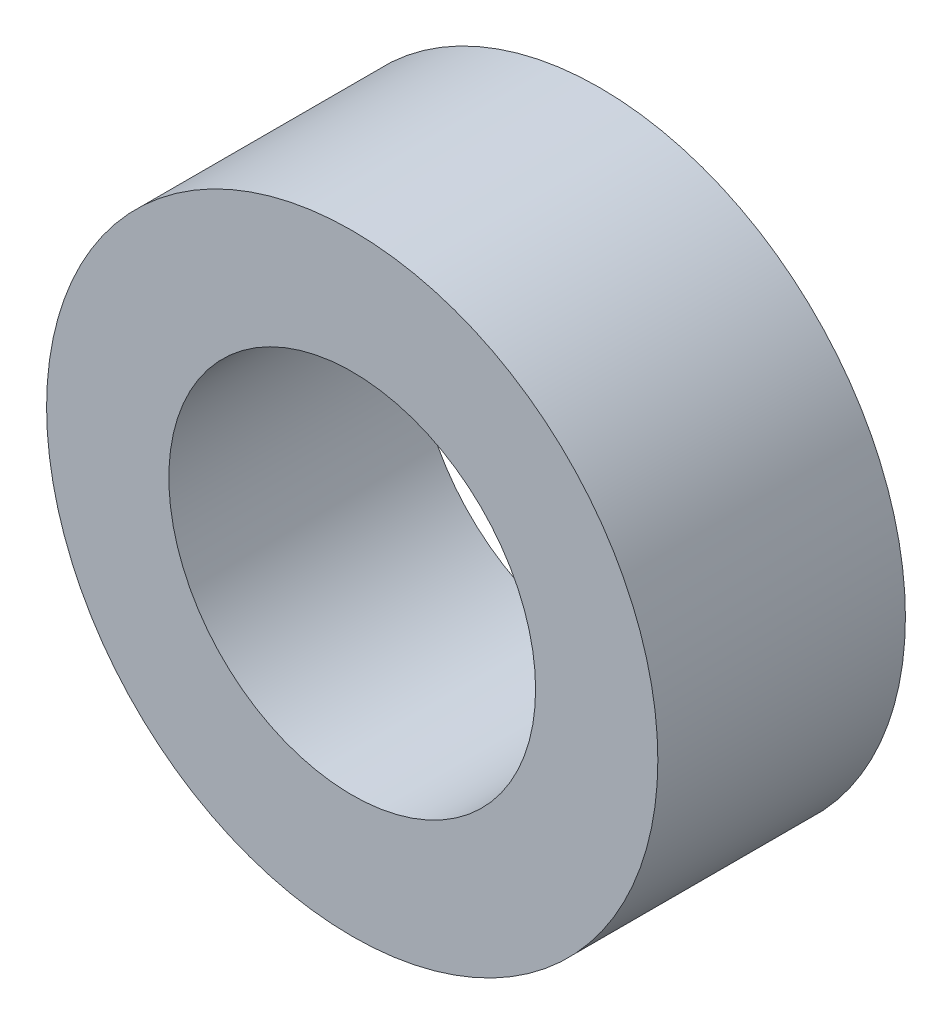
ISO-10303-21;
HEADER;
FILE_DESCRIPTION(('STEP AP214'),'2;1');
FILE_NAME('part.step','',(''),(''),'','','');
FILE_SCHEMA(('AUTOMOTIVE_DESIGN { 1 0 10303 214 1 1 1 1 }'));
ENDSEC;
DATA;
#1=APPLICATION_CONTEXT('core data for automotive mechanical design processes');
#2=APPLICATION_PROTOCOL_DEFINITION('international standard','automotive_design',2000,#1);
#3=PRODUCT_CONTEXT('',#1,'mechanical');
#4=PRODUCT('Part','Part','',(#3));
#5=PRODUCT_RELATED_PRODUCT_CATEGORY('part','',(#4));
#6=PRODUCT_DEFINITION_FORMATION('','',#4);
#7=PRODUCT_DEFINITION_CONTEXT('part definition',#1,'design');
#8=PRODUCT_DEFINITION('design','',#6,#7);
#9=PRODUCT_DEFINITION_SHAPE('','',#8);
#10=(LENGTH_UNIT() NAMED_UNIT(*) SI_UNIT(.MILLI.,.METRE.));
#11=(NAMED_UNIT(*) PLANE_ANGLE_UNIT() SI_UNIT($,.RADIAN.));
#12=(NAMED_UNIT(*) SI_UNIT($,.STERADIAN.) SOLID_ANGLE_UNIT());
#13=UNCERTAINTY_MEASURE_WITH_UNIT(LENGTH_MEASURE(1.E-05),#10,'distance_accuracy_value','');
#14=(GEOMETRIC_REPRESENTATION_CONTEXT(3) GLOBAL_UNCERTAINTY_ASSIGNED_CONTEXT((#13)) GLOBAL_UNIT_ASSIGNED_CONTEXT((#10,
#11,#12)) REPRESENTATION_CONTEXT('',''));
#15=CARTESIAN_POINT('',(0.,0.,0.));
#16=DIRECTION('',(0.,0.,1.));
#17=DIRECTION('',(1.,0.,0.));
#18=AXIS2_PLACEMENT_3D('',#15,#16,#17);
#19=CARTESIAN_POINT('',(0.,0.,10.287));
#20=DIRECTION('',(0.,0.,1.));
#21=DIRECTION('',(1.,0.,0.));
#22=AXIS2_PLACEMENT_3D('',#19,#20,#21);
#23=PLANE('',#22);
#24=CARTESIAN_POINT('',(0.,0.,10.287));
#25=DIRECTION('',(0.,0.,1.));
#26=DIRECTION('',(1.,0.,0.));
#27=AXIS2_PLACEMENT_3D('',#24,#25,#26);
#28=CIRCLE('',#27,12.7);
#29=CARTESIAN_POINT('',(12.7,0.,10.287));
#30=VERTEX_POINT('',#29);
#31=EDGE_CURVE('E10',#30,#30,#28,.T.);
#32=ORIENTED_EDGE('',*,*,#31,.T.);
#33=EDGE_LOOP('',(#32));
#34=FACE_BOUND('',#33,.T.);
#35=CARTESIAN_POINT('',(0.,0.,10.287));
#36=DIRECTION('',(0.,0.,1.));
#37=DIRECTION('',(1.,0.,0.));
#38=AXIS2_PLACEMENT_3D('',#35,#36,#37);
#39=CIRCLE('',#38,7.62);
#40=CARTESIAN_POINT('',(7.62,0.,10.287));
#41=VERTEX_POINT('',#40);
#42=EDGE_CURVE('E44',#41,#41,#39,.T.);
#43=ORIENTED_EDGE('',*,*,#42,.F.);
#44=EDGE_LOOP('',(#43));
#45=FACE_BOUND('',#44,.T.);
#46=ADVANCED_FACE('F33',(#34,#45),#23,.T.);
#47=CARTESIAN_POINT('',(0.,0.,0.));
#48=DIRECTION('',(0.,0.,1.));
#49=DIRECTION('',(1.,0.,0.));
#50=AXIS2_PLACEMENT_3D('',#47,#48,#49);
#51=PLANE('',#50);
#52=CARTESIAN_POINT('',(0.,0.,0.));
#53=DIRECTION('',(0.,0.,1.));
#54=DIRECTION('',(1.,0.,0.));
#55=AXIS2_PLACEMENT_3D('',#52,#53,#54);
#56=CIRCLE('',#55,12.7);
#57=CARTESIAN_POINT('',(12.7,0.,0.));
#58=VERTEX_POINT('',#57);
#59=EDGE_CURVE('E37',#58,#58,#56,.T.);
#60=ORIENTED_EDGE('',*,*,#59,.F.);
#61=EDGE_LOOP('',(#60));
#62=FACE_BOUND('',#61,.T.);
#63=CARTESIAN_POINT('',(0.,0.,0.));
#64=DIRECTION('',(0.,0.,1.));
#65=DIRECTION('',(1.,0.,0.));
#66=AXIS2_PLACEMENT_3D('',#63,#64,#65);
#67=CIRCLE('',#66,7.62);
#68=CARTESIAN_POINT('',(7.62,0.,0.));
#69=VERTEX_POINT('',#68);
#70=EDGE_CURVE('E46',#69,#69,#67,.T.);
#71=ORIENTED_EDGE('',*,*,#70,.T.);
#72=EDGE_LOOP('',(#71));
#73=FACE_BOUND('',#72,.T.);
#74=ADVANCED_FACE('F56',(#62,#73),#51,.F.);
#75=CARTESIAN_POINT('',(0.,0.,10.287));
#76=DIRECTION('',(0.,0.,-1.));
#77=DIRECTION('',(-1.,0.,0.));
#78=AXIS2_PLACEMENT_3D('',#75,#76,#77);
#79=CYLINDRICAL_SURFACE('',#78,12.7);
#80=ORIENTED_EDGE('',*,*,#31,.F.);
#81=EDGE_LOOP('',(#80));
#82=FACE_BOUND('',#81,.T.);
#83=ORIENTED_EDGE('',*,*,#59,.T.);
#84=EDGE_LOOP('',(#83));
#85=FACE_BOUND('',#84,.T.);
#86=ADVANCED_FACE('F35',(#82,#85),#79,.T.);
#87=CARTESIAN_POINT('',(0.,0.,10.287));
#88=DIRECTION('',(0.,0.,-1.));
#89=DIRECTION('',(-1.,0.,0.));
#90=AXIS2_PLACEMENT_3D('',#87,#88,#89);
#91=CYLINDRICAL_SURFACE('',#90,7.62);
#92=ORIENTED_EDGE('',*,*,#42,.T.);
#93=EDGE_LOOP('',(#92));
#94=FACE_BOUND('',#93,.T.);
#95=ORIENTED_EDGE('',*,*,#70,.F.);
#96=EDGE_LOOP('',(#95));
#97=FACE_BOUND('',#96,.T.);
#98=ADVANCED_FACE('F52',(#94,#97),#91,.F.);
#99=CLOSED_SHELL('',(#46,#74,#86,#98));
#100=MANIFOLD_SOLID_BREP('B2',#99);
#101=ADVANCED_BREP_SHAPE_REPRESENTATION('',(#18,#100),#14);
#102=SHAPE_DEFINITION_REPRESENTATION(#9,#101);
ENDSEC;
END-ISO-10303-21;
